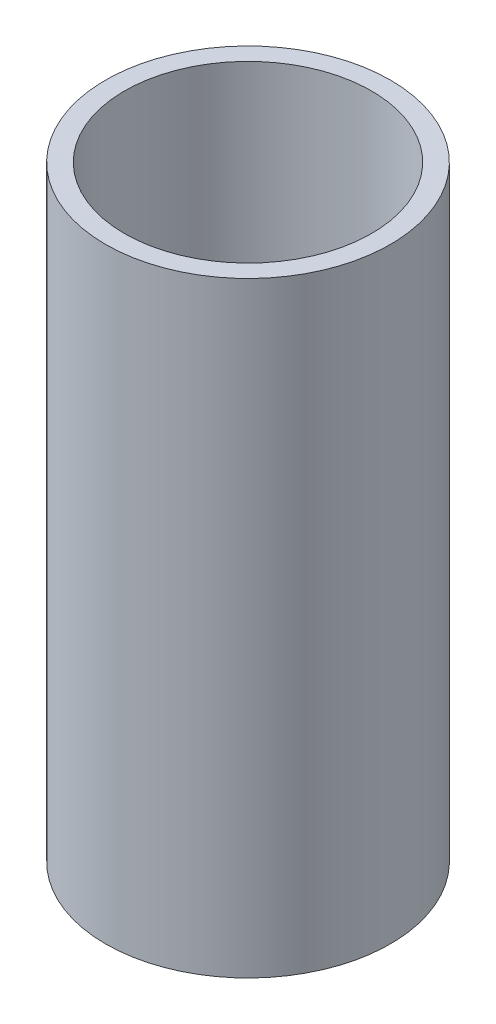
ISO-10303-21;
HEADER;
FILE_DESCRIPTION(('STEP AP214'),'2;1');
FILE_NAME('part.step','',(''),(''),'','','');
FILE_SCHEMA(('AUTOMOTIVE_DESIGN { 1 0 10303 214 1 1 1 1 }'));
ENDSEC;
DATA;
#1=APPLICATION_CONTEXT('core data for automotive mechanical design processes');
#2=APPLICATION_PROTOCOL_DEFINITION('international standard','automotive_design',2000,#1);
#3=PRODUCT_CONTEXT('',#1,'mechanical');
#4=PRODUCT('Part','Part','',(#3));
#5=PRODUCT_RELATED_PRODUCT_CATEGORY('part','',(#4));
#6=PRODUCT_DEFINITION_FORMATION('','',#4);
#7=PRODUCT_DEFINITION_CONTEXT('part definition',#1,'design');
#8=PRODUCT_DEFINITION('design','',#6,#7);
#9=PRODUCT_DEFINITION_SHAPE('','',#8);
#10=(LENGTH_UNIT() NAMED_UNIT(*) SI_UNIT(.MILLI.,.METRE.));
#11=(NAMED_UNIT(*) PLANE_ANGLE_UNIT() SI_UNIT($,.RADIAN.));
#12=(NAMED_UNIT(*) SI_UNIT($,.STERADIAN.) SOLID_ANGLE_UNIT());
#13=UNCERTAINTY_MEASURE_WITH_UNIT(LENGTH_MEASURE(1.E-05),#10,'distance_accuracy_value','');
#14=(GEOMETRIC_REPRESENTATION_CONTEXT(3) GLOBAL_UNCERTAINTY_ASSIGNED_CONTEXT((#13)) GLOBAL_UNIT_ASSIGNED_CONTEXT((#10,
#11,#12)) REPRESENTATION_CONTEXT('',''));
#15=CARTESIAN_POINT('',(0.,0.,0.));
#16=DIRECTION('',(0.,0.,1.));
#17=DIRECTION('',(1.,0.,0.));
#18=AXIS2_PLACEMENT_3D('',#15,#16,#17);
#19=CARTESIAN_POINT('',(0.,202.082616026231,0.));
#20=DIRECTION('',(0.,-1.,0.));
#21=DIRECTION('',(0.,0.,-1.));
#22=AXIS2_PLACEMENT_3D('',#19,#20,#21);
#23=CYLINDRICAL_SURFACE('',#22,47.5);
#24=CARTESIAN_POINT('',(0.,202.082616026231,0.));
#25=DIRECTION('',(0.,1.,0.));
#26=DIRECTION('',(0.,0.,1.));
#27=AXIS2_PLACEMENT_3D('',#24,#25,#26);
#28=CIRCLE('',#27,47.5);
#29=CARTESIAN_POINT('',(0.,202.082616026231,47.5));
#30=VERTEX_POINT('',#29);
#31=EDGE_CURVE('E10',#30,#30,#28,.T.);
#32=ORIENTED_EDGE('',*,*,#31,.F.);
#33=EDGE_LOOP('',(#32));
#34=FACE_BOUND('',#33,.T.);
#35=CARTESIAN_POINT('',(0.,0.,0.));
#36=DIRECTION('',(0.,1.,0.));
#37=DIRECTION('',(0.,0.,1.));
#38=AXIS2_PLACEMENT_3D('',#35,#36,#37);
#39=CIRCLE('',#38,47.5);
#40=CARTESIAN_POINT('',(0.,0.,47.5));
#41=VERTEX_POINT('',#40);
#42=EDGE_CURVE('E37',#41,#41,#39,.T.);
#43=ORIENTED_EDGE('',*,*,#42,.T.);
#44=EDGE_LOOP('',(#43));
#45=FACE_BOUND('',#44,.T.);
#46=ADVANCED_FACE('F40',(#34,#45),#23,.T.);
#47=CARTESIAN_POINT('',(0.,202.082616026231,0.));
#48=DIRECTION('',(0.,1.,0.));
#49=DIRECTION('',(0.,0.,1.));
#50=AXIS2_PLACEMENT_3D('',#47,#48,#49);
#51=PLANE('',#50);
#52=CARTESIAN_POINT('',(0.,202.082616026231,0.));
#53=DIRECTION('',(0.,1.,0.));
#54=DIRECTION('',(0.,0.,1.));
#55=AXIS2_PLACEMENT_3D('',#52,#53,#54);
#56=CIRCLE('',#55,41.2117480762005);
#57=CARTESIAN_POINT('',(0.,202.082616026231,41.2117480762005));
#58=VERTEX_POINT('',#57);
#59=EDGE_CURVE('E50',#58,#58,#56,.T.);
#60=ORIENTED_EDGE('',*,*,#59,.F.);
#61=EDGE_LOOP('',(#60));
#62=FACE_BOUND('',#61,.T.);
#63=ORIENTED_EDGE('',*,*,#31,.T.);
#64=EDGE_LOOP('',(#63));
#65=FACE_BOUND('',#64,.T.);
#66=ADVANCED_FACE('F59',(#62,#65),#51,.T.);
#67=CARTESIAN_POINT('',(0.,0.,0.));
#68=DIRECTION('',(0.,1.,0.));
#69=DIRECTION('',(0.,0.,1.));
#70=AXIS2_PLACEMENT_3D('',#67,#68,#69);
#71=PLANE('',#70);
#72=CARTESIAN_POINT('',(0.,0.,0.));
#73=DIRECTION('',(0.,1.,0.));
#74=DIRECTION('',(0.,0.,1.));
#75=AXIS2_PLACEMENT_3D('',#72,#73,#74);
#76=CIRCLE('',#75,41.2117480762005);
#77=CARTESIAN_POINT('',(0.,0.,41.2117480762005));
#78=VERTEX_POINT('',#77);
#79=EDGE_CURVE('E47',#78,#78,#76,.T.);
#80=ORIENTED_EDGE('',*,*,#79,.T.);
#81=EDGE_LOOP('',(#80));
#82=FACE_BOUND('',#81,.T.);
#83=ORIENTED_EDGE('',*,*,#42,.F.);
#84=EDGE_LOOP('',(#83));
#85=FACE_BOUND('',#84,.T.);
#86=ADVANCED_FACE('F58',(#82,#85),#71,.F.);
#87=CARTESIAN_POINT('',(0.,202.082616026231,0.));
#88=DIRECTION('',(0.,-1.,0.));
#89=DIRECTION('',(0.,0.,-1.));
#90=AXIS2_PLACEMENT_3D('',#87,#88,#89);
#91=CYLINDRICAL_SURFACE('',#90,41.2117480762005);
#92=ORIENTED_EDGE('',*,*,#59,.T.);
#93=EDGE_LOOP('',(#92));
#94=FACE_BOUND('',#93,.T.);
#95=ORIENTED_EDGE('',*,*,#79,.F.);
#96=EDGE_LOOP('',(#95));
#97=FACE_BOUND('',#96,.T.);
#98=ADVANCED_FACE('F54',(#94,#97),#91,.F.);
#99=CLOSED_SHELL('',(#46,#66,#86,#98));
#100=MANIFOLD_SOLID_BREP('B2',#99);
#101=ADVANCED_BREP_SHAPE_REPRESENTATION('',(#18,#100),#14);
#102=SHAPE_DEFINITION_REPRESENTATION(#9,#101);
ENDSEC;
END-ISO-10303-21;
